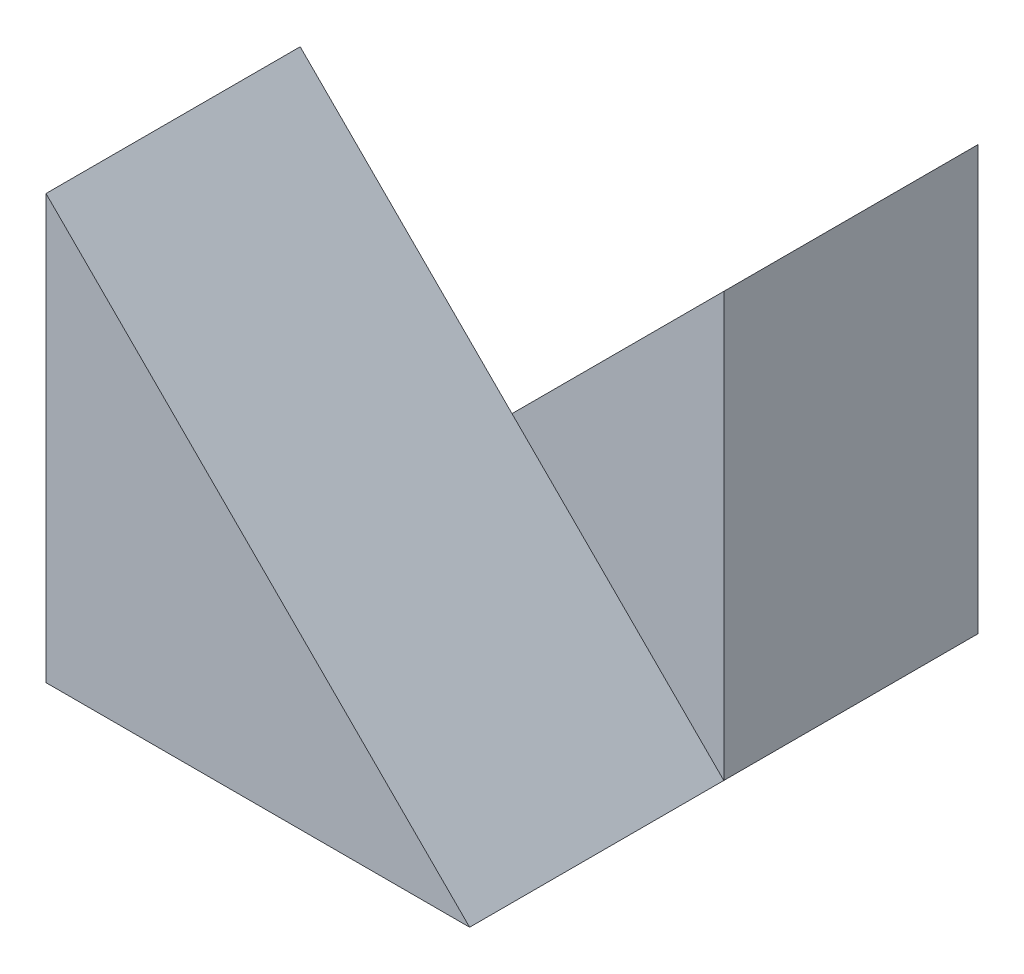
ISO-10303-21;
HEADER;
FILE_DESCRIPTION(('STEP AP214'),'2;1');
FILE_NAME('part.step','',(''),(''),'','','');
FILE_SCHEMA(('AUTOMOTIVE_DESIGN { 1 0 10303 214 1 1 1 1 }'));
ENDSEC;
DATA;
#1=APPLICATION_CONTEXT('core data for automotive mechanical design processes');
#2=APPLICATION_PROTOCOL_DEFINITION('international standard','automotive_design',2000,#1);
#3=PRODUCT_CONTEXT('',#1,'mechanical');
#4=PRODUCT('Part','Part','',(#3));
#5=PRODUCT_RELATED_PRODUCT_CATEGORY('part','',(#4));
#6=PRODUCT_DEFINITION_FORMATION('','',#4);
#7=PRODUCT_DEFINITION_CONTEXT('part definition',#1,'design');
#8=PRODUCT_DEFINITION('design','',#6,#7);
#9=PRODUCT_DEFINITION_SHAPE('','',#8);
#10=(LENGTH_UNIT() NAMED_UNIT(*) SI_UNIT(.MILLI.,.METRE.));
#11=(NAMED_UNIT(*) PLANE_ANGLE_UNIT() SI_UNIT($,.RADIAN.));
#12=(NAMED_UNIT(*) SI_UNIT($,.STERADIAN.) SOLID_ANGLE_UNIT());
#13=UNCERTAINTY_MEASURE_WITH_UNIT(LENGTH_MEASURE(1.E-05),#10,'distance_accuracy_value','');
#14=(GEOMETRIC_REPRESENTATION_CONTEXT(3) GLOBAL_UNCERTAINTY_ASSIGNED_CONTEXT((#13)) GLOBAL_UNIT_ASSIGNED_CONTEXT((#10,
#11,#12)) REPRESENTATION_CONTEXT('',''));
#15=CARTESIAN_POINT('',(0.,0.,0.));
#16=DIRECTION('',(0.,0.,1.));
#17=DIRECTION('',(1.,0.,0.));
#18=AXIS2_PLACEMENT_3D('',#15,#16,#17);
#19=CARTESIAN_POINT('',(0.,0.,0.));
#20=DIRECTION('',(0.,0.,1.));
#21=DIRECTION('',(1.,0.,0.));
#22=AXIS2_PLACEMENT_3D('',#19,#20,#21);
#23=PLANE('',#22);
#24=DIRECTION('',(0.707106781186547,0.707106781186547,0.));
#25=VECTOR('',#24,1.);
#26=CARTESIAN_POINT('',(25.,25.,0.));
#27=LINE('',#26,#25);
#28=CARTESIAN_POINT('',(0.,0.,0.));
#29=VERTEX_POINT('',#28);
#30=CARTESIAN_POINT('',(12.5,12.5,0.));
#31=VERTEX_POINT('',#30);
#32=EDGE_CURVE('E65',#29,#31,#27,.T.);
#33=ORIENTED_EDGE('',*,*,#32,.F.);
#34=DIRECTION('',(0.,-1.,0.));
#35=VECTOR('',#34,1.);
#36=CARTESIAN_POINT('',(0.,25.,0.));
#37=LINE('',#36,#35);
#38=CARTESIAN_POINT('',(0.,25.,0.));
#39=VERTEX_POINT('',#38);
#40=EDGE_CURVE('E124',#39,#29,#37,.T.);
#41=ORIENTED_EDGE('',*,*,#40,.F.);
#42=DIRECTION('',(-0.707106781186547,0.707106781186547,0.));
#43=VECTOR('',#42,1.);
#44=CARTESIAN_POINT('',(25.,0.,0.));
#45=LINE('',#44,#43);
#46=EDGE_CURVE('E114',#31,#39,#45,.T.);
#47=ORIENTED_EDGE('',*,*,#46,.F.);
#48=EDGE_LOOP('',(#33,#41,#47));
#49=FACE_BOUND('',#48,.T.);
#50=ADVANCED_FACE('F33',(#49),#23,.F.);
#51=CARTESIAN_POINT('',(25.,0.,15.));
#52=DIRECTION('',(-0.707106781186547,-0.707106781186547,0.));
#53=DIRECTION('',(0.707106781186548,-0.707106781186548,0.));
#54=AXIS2_PLACEMENT_3D('',#51,#52,#53);
#55=PLANE('',#54);
#56=CARTESIAN_POINT('',(25.,0.,0.));
#57=VERTEX_POINT('',#56);
#58=EDGE_CURVE('E116',#57,#31,#45,.T.);
#59=ORIENTED_EDGE('',*,*,#58,.T.);
#60=ORIENTED_EDGE('',*,*,#46,.T.);
#61=DIRECTION('',(0.,0.,-1.));
#62=VECTOR('',#61,1.);
#63=CARTESIAN_POINT('',(0.,25.,15.));
#64=LINE('',#63,#62);
#65=CARTESIAN_POINT('',(0.,25.,15.));
#66=VERTEX_POINT('',#65);
#67=EDGE_CURVE('E11',#66,#39,#64,.T.);
#68=ORIENTED_EDGE('',*,*,#67,.F.);
#69=DIRECTION('',(-0.707106781186547,0.707106781186547,0.));
#70=VECTOR('',#69,1.);
#71=CARTESIAN_POINT('',(25.,0.,15.));
#72=LINE('',#71,#70);
#73=CARTESIAN_POINT('',(25.,0.,15.));
#74=VERTEX_POINT('',#73);
#75=EDGE_CURVE('E122',#74,#66,#72,.T.);
#76=ORIENTED_EDGE('',*,*,#75,.F.);
#77=DIRECTION('',(0.,0.,-1.));
#78=VECTOR('',#77,1.);
#79=CARTESIAN_POINT('',(25.,0.,15.));
#80=LINE('',#79,#78);
#81=EDGE_CURVE('E71',#74,#57,#80,.T.);
#82=ORIENTED_EDGE('',*,*,#81,.T.);
#83=EDGE_LOOP('',(#59,#60,#68,#76,#82));
#84=FACE_BOUND('',#83,.T.);
#85=ADVANCED_FACE('F35',(#84),#55,.F.);
#86=CARTESIAN_POINT('',(0.,25.,15.));
#87=DIRECTION('',(1.,0.,0.));
#88=DIRECTION('',(0.,0.,-1.));
#89=AXIS2_PLACEMENT_3D('',#86,#87,#88);
#90=PLANE('',#89);
#91=ORIENTED_EDGE('',*,*,#40,.T.);
#92=DIRECTION('',(0.,0.,-1.));
#93=VECTOR('',#92,1.);
#94=CARTESIAN_POINT('',(0.,0.,15.));
#95=LINE('',#94,#93);
#96=CARTESIAN_POINT('',(0.,0.,15.));
#97=VERTEX_POINT('',#96);
#98=EDGE_CURVE('E42',#97,#29,#95,.T.);
#99=ORIENTED_EDGE('',*,*,#98,.F.);
#100=DIRECTION('',(0.,-1.,0.));
#101=VECTOR('',#100,1.);
#102=CARTESIAN_POINT('',(0.,25.,15.));
#103=LINE('',#102,#101);
#104=EDGE_CURVE('E76',#66,#97,#103,.T.);
#105=ORIENTED_EDGE('',*,*,#104,.F.);
#106=ORIENTED_EDGE('',*,*,#67,.T.);
#107=EDGE_LOOP('',(#91,#99,#105,#106));
#108=FACE_BOUND('',#107,.T.);
#109=ADVANCED_FACE('F128',(#108),#90,.F.);
#110=CARTESIAN_POINT('',(0.,0.,15.));
#111=DIRECTION('',(0.,1.,0.));
#112=DIRECTION('',(0.,0.,1.));
#113=AXIS2_PLACEMENT_3D('',#110,#111,#112);
#114=PLANE('',#113);
#115=ORIENTED_EDGE('',*,*,#98,.T.);
#116=DIRECTION('',(0.,0.,1.));
#117=VECTOR('',#116,1.);
#118=CARTESIAN_POINT('',(0.,0.,-15.));
#119=LINE('',#118,#117);
#120=CARTESIAN_POINT('',(0.,0.,-15.));
#121=VERTEX_POINT('',#120);
#122=EDGE_CURVE('E97',#121,#29,#119,.T.);
#123=ORIENTED_EDGE('',*,*,#122,.F.);
#124=DIRECTION('',(-1.,0.,0.));
#125=VECTOR('',#124,1.);
#126=CARTESIAN_POINT('',(0.,0.,-15.));
#127=LINE('',#126,#125);
#128=CARTESIAN_POINT('',(25.,0.,-15.));
#129=VERTEX_POINT('',#128);
#130=EDGE_CURVE('E103',#129,#121,#127,.T.);
#131=ORIENTED_EDGE('',*,*,#130,.F.);
#132=DIRECTION('',(0.,0.,1.));
#133=VECTOR('',#132,1.);
#134=CARTESIAN_POINT('',(25.,0.,-15.));
#135=LINE('',#134,#133);
#136=EDGE_CURVE('E118',#129,#57,#135,.T.);
#137=ORIENTED_EDGE('',*,*,#136,.T.);
#138=ORIENTED_EDGE('',*,*,#81,.F.);
#139=DIRECTION('',(1.,0.,0.));
#140=VECTOR('',#139,1.);
#141=CARTESIAN_POINT('',(0.,0.,15.));
#142=LINE('',#141,#140);
#143=EDGE_CURVE('E50',#97,#74,#142,.T.);
#144=ORIENTED_EDGE('',*,*,#143,.F.);
#145=EDGE_LOOP('',(#115,#123,#131,#137,#138,#144));
#146=FACE_BOUND('',#145,.T.);
#147=ADVANCED_FACE('F113',(#146),#114,.F.);
#148=CARTESIAN_POINT('',(0.,0.,15.));
#149=DIRECTION('',(0.,0.,1.));
#150=DIRECTION('',(1.,0.,0.));
#151=AXIS2_PLACEMENT_3D('',#148,#149,#150);
#152=PLANE('',#151);
#153=ORIENTED_EDGE('',*,*,#75,.T.);
#154=ORIENTED_EDGE('',*,*,#104,.T.);
#155=ORIENTED_EDGE('',*,*,#143,.T.);
#156=EDGE_LOOP('',(#153,#154,#155));
#157=FACE_BOUND('',#156,.T.);
#158=ADVANCED_FACE('F157',(#157),#152,.T.);
#159=CARTESIAN_POINT('',(0.,0.,0.));
#160=DIRECTION('',(0.,0.,1.));
#161=DIRECTION('',(1.,0.,0.));
#162=AXIS2_PLACEMENT_3D('',#159,#160,#161);
#163=PLANE('',#162);
#164=ORIENTED_EDGE('',*,*,#58,.F.);
#165=DIRECTION('',(0.,-1.,0.));
#166=VECTOR('',#165,1.);
#167=CARTESIAN_POINT('',(25.,0.,0.));
#168=LINE('',#167,#166);
#169=CARTESIAN_POINT('',(25.,25.,0.));
#170=VERTEX_POINT('',#169);
#171=EDGE_CURVE('E110',#170,#57,#168,.T.);
#172=ORIENTED_EDGE('',*,*,#171,.F.);
#173=EDGE_CURVE('E133',#31,#170,#27,.T.);
#174=ORIENTED_EDGE('',*,*,#173,.F.);
#175=EDGE_LOOP('',(#164,#172,#174));
#176=FACE_BOUND('',#175,.T.);
#177=ADVANCED_FACE('F134',(#176),#163,.T.);
#178=CARTESIAN_POINT('',(25.,25.,-15.));
#179=DIRECTION('',(0.707106781186547,-0.707106781186547,0.));
#180=DIRECTION('',(0.707106781186548,0.707106781186548,0.));
#181=AXIS2_PLACEMENT_3D('',#178,#179,#180);
#182=PLANE('',#181);
#183=ORIENTED_EDGE('',*,*,#32,.T.);
#184=ORIENTED_EDGE('',*,*,#173,.T.);
#185=DIRECTION('',(0.,0.,1.));
#186=VECTOR('',#185,1.);
#187=CARTESIAN_POINT('',(25.,25.,-15.));
#188=LINE('',#187,#186);
#189=CARTESIAN_POINT('',(25.,25.,-15.));
#190=VERTEX_POINT('',#189);
#191=EDGE_CURVE('E99',#190,#170,#188,.T.);
#192=ORIENTED_EDGE('',*,*,#191,.F.);
#193=DIRECTION('',(0.707106781186547,0.707106781186547,0.));
#194=VECTOR('',#193,1.);
#195=CARTESIAN_POINT('',(25.,25.,-15.));
#196=LINE('',#195,#194);
#197=EDGE_CURVE('E93',#121,#190,#196,.T.);
#198=ORIENTED_EDGE('',*,*,#197,.F.);
#199=ORIENTED_EDGE('',*,*,#122,.T.);
#200=EDGE_LOOP('',(#183,#184,#192,#198,#199));
#201=FACE_BOUND('',#200,.T.);
#202=ADVANCED_FACE('F95',(#201),#182,.F.);
#203=CARTESIAN_POINT('',(25.,0.,-15.));
#204=DIRECTION('',(-1.,0.,0.));
#205=DIRECTION('',(0.,0.,1.));
#206=AXIS2_PLACEMENT_3D('',#203,#204,#205);
#207=PLANE('',#206);
#208=ORIENTED_EDGE('',*,*,#171,.T.);
#209=ORIENTED_EDGE('',*,*,#136,.F.);
#210=DIRECTION('',(0.,-1.,0.));
#211=VECTOR('',#210,1.);
#212=CARTESIAN_POINT('',(25.,0.,-15.));
#213=LINE('',#212,#211);
#214=EDGE_CURVE('E102',#190,#129,#213,.T.);
#215=ORIENTED_EDGE('',*,*,#214,.F.);
#216=ORIENTED_EDGE('',*,*,#191,.T.);
#217=EDGE_LOOP('',(#208,#209,#215,#216));
#218=FACE_BOUND('',#217,.T.);
#219=ADVANCED_FACE('F140',(#218),#207,.F.);
#220=CARTESIAN_POINT('',(0.,0.,-15.));
#221=DIRECTION('',(0.,0.,1.));
#222=DIRECTION('',(1.,0.,0.));
#223=AXIS2_PLACEMENT_3D('',#220,#221,#222);
#224=PLANE('',#223);
#225=ORIENTED_EDGE('',*,*,#130,.T.);
#226=ORIENTED_EDGE('',*,*,#197,.T.);
#227=ORIENTED_EDGE('',*,*,#214,.T.);
#228=EDGE_LOOP('',(#225,#226,#227));
#229=FACE_BOUND('',#228,.T.);
#230=ADVANCED_FACE('F106',(#229),#224,.F.);
#231=CLOSED_SHELL('',(#50,#85,#109,#147,#158,#177,#202,#219,#230));
#232=MANIFOLD_SOLID_BREP('B2',#231);
#233=ADVANCED_BREP_SHAPE_REPRESENTATION('',(#18,#232),#14);
#234=SHAPE_DEFINITION_REPRESENTATION(#9,#233);
ENDSEC;
END-ISO-10303-21;
